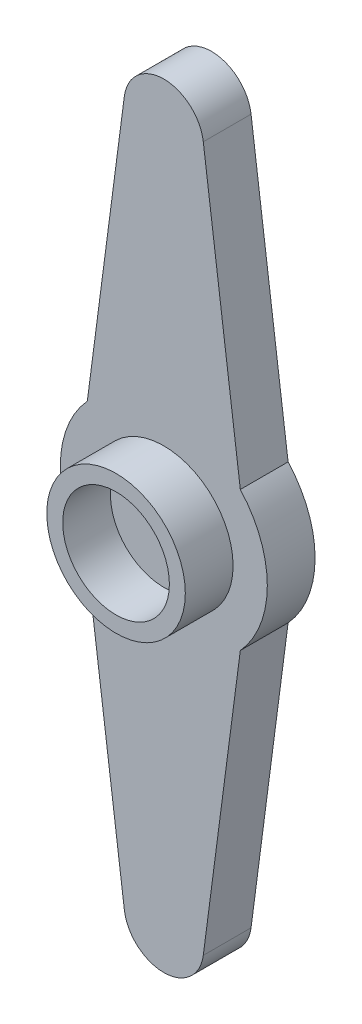
ISO-10303-21;
HEADER;
FILE_DESCRIPTION(('STEP AP214'),'2;1');
FILE_NAME('part.step','',(''),(''),'','','');
FILE_SCHEMA(('AUTOMOTIVE_DESIGN { 1 0 10303 214 1 1 1 1 }'));
ENDSEC;
DATA;
#1=APPLICATION_CONTEXT('core data for automotive mechanical design processes');
#2=APPLICATION_PROTOCOL_DEFINITION('international standard','automotive_design',2000,#1);
#3=PRODUCT_CONTEXT('',#1,'mechanical');
#4=PRODUCT('Part','Part','',(#3));
#5=PRODUCT_RELATED_PRODUCT_CATEGORY('part','',(#4));
#6=PRODUCT_DEFINITION_FORMATION('','',#4);
#7=PRODUCT_DEFINITION_CONTEXT('part definition',#1,'design');
#8=PRODUCT_DEFINITION('design','',#6,#7);
#9=PRODUCT_DEFINITION_SHAPE('','',#8);
#10=(LENGTH_UNIT() NAMED_UNIT(*) SI_UNIT(.MILLI.,.METRE.));
#11=(NAMED_UNIT(*) PLANE_ANGLE_UNIT() SI_UNIT($,.RADIAN.));
#12=(NAMED_UNIT(*) SI_UNIT($,.STERADIAN.) SOLID_ANGLE_UNIT());
#13=UNCERTAINTY_MEASURE_WITH_UNIT(LENGTH_MEASURE(1.E-05),#10,'distance_accuracy_value','');
#14=(GEOMETRIC_REPRESENTATION_CONTEXT(3) GLOBAL_UNCERTAINTY_ASSIGNED_CONTEXT((#13)) GLOBAL_UNIT_ASSIGNED_CONTEXT((#10,
#11,#12)) REPRESENTATION_CONTEXT('',''));
#15=CARTESIAN_POINT('',(0.,0.,0.));
#16=DIRECTION('',(0.,0.,1.));
#17=DIRECTION('',(1.,0.,0.));
#18=AXIS2_PLACEMENT_3D('',#15,#16,#17);
#19=CARTESIAN_POINT('',(0.,21.8,3.));
#20=DIRECTION('',(0.,0.,1.));
#21=DIRECTION('',(1.,0.,0.));
#22=AXIS2_PLACEMENT_3D('',#19,#20,#21);
#23=PLANE('',#22);
#24=CARTESIAN_POINT('',(0.,21.8,3.));
#25=DIRECTION('',(0.,0.,1.));
#26=DIRECTION('',(1.,0.,0.));
#27=AXIS2_PLACEMENT_3D('',#24,#25,#26);
#28=CIRCLE('',#27,2.5);
#29=CARTESIAN_POINT('',(2.47880079624715,22.124879381501,3.));
#30=VERTEX_POINT('',#29);
#31=CARTESIAN_POINT('',(-2.47880079624715,22.124879381501,3.));
#32=VERTEX_POINT('',#31);
#33=EDGE_CURVE('E156',#30,#32,#28,.T.);
#34=ORIENTED_EDGE('',*,*,#33,.T.);
#35=DIRECTION('',(-0.129951752600411,-0.99152031849886,0.));
#36=VECTOR('',#35,1.);
#37=CARTESIAN_POINT('',(-2.47880079624715,22.124879381501,3.));
#38=LINE('',#37,#36);
#39=CARTESIAN_POINT('',(-4.80480817683197,4.3776498699472,3.));
#40=VERTEX_POINT('',#39);
#41=EDGE_CURVE('E104',#32,#40,#38,.T.);
#42=ORIENTED_EDGE('',*,*,#41,.T.);
#43=CARTESIAN_POINT('',(0.,0.,3.));
#44=DIRECTION('',(0.,0.,1.));
#45=DIRECTION('',(1.,0.,0.));
#46=AXIS2_PLACEMENT_3D('',#43,#44,#45);
#47=CIRCLE('',#46,6.50000000000001);
#48=CARTESIAN_POINT('',(-4.80480817683199,-4.37764986994717,3.));
#49=VERTEX_POINT('',#48);
#50=EDGE_CURVE('E187',#40,#49,#47,.T.);
#51=ORIENTED_EDGE('',*,*,#50,.T.);
#52=DIRECTION('',(0.129951752600404,-0.991520318498861,0.));
#53=VECTOR('',#52,1.);
#54=CARTESIAN_POINT('',(-2.47880079624731,-22.124879381501,3.));
#55=LINE('',#54,#53);
#56=CARTESIAN_POINT('',(-2.47880079624731,-22.124879381501,3.));
#57=VERTEX_POINT('',#56);
#58=EDGE_CURVE('E186',#49,#57,#55,.T.);
#59=ORIENTED_EDGE('',*,*,#58,.T.);
#60=CARTESIAN_POINT('',(-1.52228586373561E-13,-21.8,3.));
#61=DIRECTION('',(0.,0.,1.));
#62=DIRECTION('',(1.,0.,0.));
#63=AXIS2_PLACEMENT_3D('',#60,#61,#62);
#64=CIRCLE('',#63,2.5);
#65=CARTESIAN_POINT('',(2.478800796247,-22.124879381501,3.));
#66=VERTEX_POINT('',#65);
#67=EDGE_CURVE('E123',#57,#66,#64,.T.);
#68=ORIENTED_EDGE('',*,*,#67,.T.);
#69=DIRECTION('',(0.129951752600418,0.991520318498859,0.));
#70=VECTOR('',#69,1.);
#71=CARTESIAN_POINT('',(2.478800796247,-22.124879381501,3.));
#72=LINE('',#71,#70);
#73=CARTESIAN_POINT('',(4.80480817683194,-4.37764986994723,3.));
#74=VERTEX_POINT('',#73);
#75=EDGE_CURVE('E117',#66,#74,#72,.T.);
#76=ORIENTED_EDGE('',*,*,#75,.T.);
#77=CARTESIAN_POINT('',(0.,0.,3.));
#78=DIRECTION('',(0.,0.,1.));
#79=DIRECTION('',(1.,0.,0.));
#80=AXIS2_PLACEMENT_3D('',#77,#78,#79);
#81=CIRCLE('',#80,6.50000000000001);
#82=CARTESIAN_POINT('',(4.80480817683196,4.37764986994721,3.));
#83=VERTEX_POINT('',#82);
#84=EDGE_CURVE('E121',#74,#83,#81,.T.);
#85=ORIENTED_EDGE('',*,*,#84,.T.);
#86=DIRECTION('',(-0.129951752600411,0.99152031849886,0.));
#87=VECTOR('',#86,1.);
#88=CARTESIAN_POINT('',(2.47880079624715,22.124879381501,3.));
#89=LINE('',#88,#87);
#90=EDGE_CURVE('E60',#83,#30,#89,.T.);
#91=ORIENTED_EDGE('',*,*,#90,.T.);
#92=EDGE_LOOP('',(#34,#42,#51,#59,#68,#76,#85,#91));
#93=FACE_BOUND('',#92,.T.);
#94=CARTESIAN_POINT('',(0.,0.,3.));
#95=DIRECTION('',(0.,0.,1.));
#96=DIRECTION('',(1.,0.,0.));
#97=AXIS2_PLACEMENT_3D('',#94,#95,#96);
#98=CIRCLE('',#97,4.35);
#99=CARTESIAN_POINT('',(4.35,0.,3.));
#100=VERTEX_POINT('',#99);
#101=EDGE_CURVE('E196',#100,#100,#98,.T.);
#102=ORIENTED_EDGE('',*,*,#101,.F.);
#103=EDGE_LOOP('',(#102));
#104=FACE_BOUND('',#103,.T.);
#105=ADVANCED_FACE('F43',(#93,#104),#23,.T.);
#106=CARTESIAN_POINT('',(0.,21.8,3.));
#107=DIRECTION('',(0.,0.,-1.));
#108=DIRECTION('',(-1.,0.,0.));
#109=AXIS2_PLACEMENT_3D('',#106,#107,#108);
#110=CYLINDRICAL_SURFACE('',#109,2.5);
#111=CARTESIAN_POINT('',(0.,21.8,0.));
#112=DIRECTION('',(0.,0.,1.));
#113=DIRECTION('',(1.,0.,0.));
#114=AXIS2_PLACEMENT_3D('',#111,#112,#113);
#115=CIRCLE('',#114,2.5);
#116=CARTESIAN_POINT('',(2.47880079624715,22.124879381501,0.));
#117=VERTEX_POINT('',#116);
#118=CARTESIAN_POINT('',(-2.47880079624715,22.124879381501,0.));
#119=VERTEX_POINT('',#118);
#120=EDGE_CURVE('E141',#117,#119,#115,.T.);
#121=ORIENTED_EDGE('',*,*,#120,.T.);
#122=DIRECTION('',(0.,0.,-1.));
#123=VECTOR('',#122,1.);
#124=CARTESIAN_POINT('',(-2.47880079624715,22.124879381501,3.));
#125=LINE('',#124,#123);
#126=EDGE_CURVE('E52',#32,#119,#125,.T.);
#127=ORIENTED_EDGE('',*,*,#126,.F.);
#128=ORIENTED_EDGE('',*,*,#33,.F.);
#129=DIRECTION('',(0.,0.,-1.));
#130=VECTOR('',#129,1.);
#131=CARTESIAN_POINT('',(2.47880079624715,22.124879381501,3.));
#132=LINE('',#131,#130);
#133=EDGE_CURVE('E137',#30,#117,#132,.T.);
#134=ORIENTED_EDGE('',*,*,#133,.T.);
#135=EDGE_LOOP('',(#121,#127,#128,#134));
#136=FACE_BOUND('',#135,.T.);
#137=ADVANCED_FACE('F45',(#136),#110,.T.);
#138=CARTESIAN_POINT('',(-2.47880079624715,22.124879381501,3.));
#139=DIRECTION('',(0.99152031849886,-0.129951752600411,0.));
#140=DIRECTION('',(0.129951752600411,0.99152031849886,0.));
#141=AXIS2_PLACEMENT_3D('',#138,#139,#140);
#142=PLANE('',#141);
#143=DIRECTION('',(-0.129951752600411,-0.99152031849886,0.));
#144=VECTOR('',#143,1.);
#145=CARTESIAN_POINT('',(-2.47880079624715,22.124879381501,0.));
#146=LINE('',#145,#144);
#147=CARTESIAN_POINT('',(-4.80480817683197,4.3776498699472,0.));
#148=VERTEX_POINT('',#147);
#149=EDGE_CURVE('E144',#119,#148,#146,.T.);
#150=ORIENTED_EDGE('',*,*,#149,.T.);
#151=DIRECTION('',(0.,0.,-1.));
#152=VECTOR('',#151,1.);
#153=CARTESIAN_POINT('',(-4.80480817683197,4.3776498699472,3.));
#154=LINE('',#153,#152);
#155=EDGE_CURVE('E166',#40,#148,#154,.T.);
#156=ORIENTED_EDGE('',*,*,#155,.F.);
#157=ORIENTED_EDGE('',*,*,#41,.F.);
#158=ORIENTED_EDGE('',*,*,#126,.T.);
#159=EDGE_LOOP('',(#150,#156,#157,#158));
#160=FACE_BOUND('',#159,.T.);
#161=ADVANCED_FACE('F169',(#160),#142,.F.);
#162=CARTESIAN_POINT('',(0.,0.,3.));
#163=DIRECTION('',(0.,0.,-1.));
#164=DIRECTION('',(-1.,0.,0.));
#165=AXIS2_PLACEMENT_3D('',#162,#163,#164);
#166=CYLINDRICAL_SURFACE('',#165,6.50000000000001);
#167=CARTESIAN_POINT('',(0.,0.,0.));
#168=DIRECTION('',(0.,0.,1.));
#169=DIRECTION('',(1.,0.,0.));
#170=AXIS2_PLACEMENT_3D('',#167,#168,#169);
#171=CIRCLE('',#170,6.50000000000001);
#172=CARTESIAN_POINT('',(-4.80480817683199,-4.37764986994717,0.));
#173=VERTEX_POINT('',#172);
#174=EDGE_CURVE('E147',#148,#173,#171,.T.);
#175=ORIENTED_EDGE('',*,*,#174,.T.);
#176=DIRECTION('',(0.,0.,-1.));
#177=VECTOR('',#176,1.);
#178=CARTESIAN_POINT('',(-4.80480817683199,-4.37764986994717,3.));
#179=LINE('',#178,#177);
#180=EDGE_CURVE('E163',#49,#173,#179,.T.);
#181=ORIENTED_EDGE('',*,*,#180,.F.);
#182=ORIENTED_EDGE('',*,*,#50,.F.);
#183=ORIENTED_EDGE('',*,*,#155,.T.);
#184=EDGE_LOOP('',(#175,#181,#182,#183));
#185=FACE_BOUND('',#184,.T.);
#186=ADVANCED_FACE('F180',(#185),#166,.T.);
#187=CARTESIAN_POINT('',(-2.47880079624731,-22.124879381501,3.));
#188=DIRECTION('',(0.991520318498861,0.129951752600404,0.));
#189=DIRECTION('',(-0.129951752600404,0.991520318498861,0.));
#190=AXIS2_PLACEMENT_3D('',#187,#188,#189);
#191=PLANE('',#190);
#192=DIRECTION('',(0.129951752600404,-0.991520318498861,0.));
#193=VECTOR('',#192,1.);
#194=CARTESIAN_POINT('',(-2.47880079624731,-22.124879381501,0.));
#195=LINE('',#194,#193);
#196=CARTESIAN_POINT('',(-2.47880079624731,-22.124879381501,0.));
#197=VERTEX_POINT('',#196);
#198=EDGE_CURVE('E149',#173,#197,#195,.T.);
#199=ORIENTED_EDGE('',*,*,#198,.T.);
#200=DIRECTION('',(0.,0.,-1.));
#201=VECTOR('',#200,1.);
#202=CARTESIAN_POINT('',(-2.47880079624731,-22.124879381501,3.));
#203=LINE('',#202,#201);
#204=EDGE_CURVE('E160',#57,#197,#203,.T.);
#205=ORIENTED_EDGE('',*,*,#204,.F.);
#206=ORIENTED_EDGE('',*,*,#58,.F.);
#207=ORIENTED_EDGE('',*,*,#180,.T.);
#208=EDGE_LOOP('',(#199,#205,#206,#207));
#209=FACE_BOUND('',#208,.T.);
#210=ADVANCED_FACE('F184',(#209),#191,.F.);
#211=CARTESIAN_POINT('',(-1.52228586373561E-13,-21.8,3.));
#212=DIRECTION('',(0.,0.,-1.));
#213=DIRECTION('',(-1.,0.,0.));
#214=AXIS2_PLACEMENT_3D('',#211,#212,#213);
#215=CYLINDRICAL_SURFACE('',#214,2.5);
#216=CARTESIAN_POINT('',(-1.52228586373561E-13,-21.8,0.));
#217=DIRECTION('',(0.,0.,1.));
#218=DIRECTION('',(1.,0.,0.));
#219=AXIS2_PLACEMENT_3D('',#216,#217,#218);
#220=CIRCLE('',#219,2.5);
#221=CARTESIAN_POINT('',(2.478800796247,-22.124879381501,0.));
#222=VERTEX_POINT('',#221);
#223=EDGE_CURVE('E151',#197,#222,#220,.T.);
#224=ORIENTED_EDGE('',*,*,#223,.T.);
#225=DIRECTION('',(0.,0.,-1.));
#226=VECTOR('',#225,1.);
#227=CARTESIAN_POINT('',(2.478800796247,-22.124879381501,3.));
#228=LINE('',#227,#226);
#229=EDGE_CURVE('E132',#66,#222,#228,.T.);
#230=ORIENTED_EDGE('',*,*,#229,.F.);
#231=ORIENTED_EDGE('',*,*,#67,.F.);
#232=ORIENTED_EDGE('',*,*,#204,.T.);
#233=EDGE_LOOP('',(#224,#230,#231,#232));
#234=FACE_BOUND('',#233,.T.);
#235=ADVANCED_FACE('F279',(#234),#215,.T.);
#236=CARTESIAN_POINT('',(2.478800796247,-22.124879381501,3.));
#237=DIRECTION('',(-0.99152031849886,0.129951752600418,0.));
#238=DIRECTION('',(-0.129951752600418,-0.99152031849886,0.));
#239=AXIS2_PLACEMENT_3D('',#236,#237,#238);
#240=PLANE('',#239);
#241=DIRECTION('',(0.129951752600418,0.991520318498859,0.));
#242=VECTOR('',#241,1.);
#243=CARTESIAN_POINT('',(2.478800796247,-22.124879381501,0.));
#244=LINE('',#243,#242);
#245=CARTESIAN_POINT('',(4.80480817683194,-4.37764986994723,0.));
#246=VERTEX_POINT('',#245);
#247=EDGE_CURVE('E131',#222,#246,#244,.T.);
#248=ORIENTED_EDGE('',*,*,#247,.T.);
#249=DIRECTION('',(0.,0.,-1.));
#250=VECTOR('',#249,1.);
#251=CARTESIAN_POINT('',(4.80480817683194,-4.37764986994723,3.));
#252=LINE('',#251,#250);
#253=EDGE_CURVE('E128',#74,#246,#252,.T.);
#254=ORIENTED_EDGE('',*,*,#253,.F.);
#255=ORIENTED_EDGE('',*,*,#75,.F.);
#256=ORIENTED_EDGE('',*,*,#229,.T.);
#257=EDGE_LOOP('',(#248,#254,#255,#256));
#258=FACE_BOUND('',#257,.T.);
#259=ADVANCED_FACE('F129',(#258),#240,.F.);
#260=CARTESIAN_POINT('',(0.,0.,3.));
#261=DIRECTION('',(0.,0.,-1.));
#262=DIRECTION('',(-1.,0.,0.));
#263=AXIS2_PLACEMENT_3D('',#260,#261,#262);
#264=CYLINDRICAL_SURFACE('',#263,6.50000000000001);
#265=CARTESIAN_POINT('',(0.,0.,0.));
#266=DIRECTION('',(0.,0.,1.));
#267=DIRECTION('',(1.,0.,0.));
#268=AXIS2_PLACEMENT_3D('',#265,#266,#267);
#269=CIRCLE('',#268,6.50000000000001);
#270=CARTESIAN_POINT('',(4.80480817683196,4.37764986994721,0.));
#271=VERTEX_POINT('',#270);
#272=EDGE_CURVE('E89',#246,#271,#269,.T.);
#273=ORIENTED_EDGE('',*,*,#272,.T.);
#274=DIRECTION('',(0.,0.,-1.));
#275=VECTOR('',#274,1.);
#276=CARTESIAN_POINT('',(4.80480817683196,4.37764986994721,3.));
#277=LINE('',#276,#275);
#278=EDGE_CURVE('E133',#83,#271,#277,.T.);
#279=ORIENTED_EDGE('',*,*,#278,.F.);
#280=ORIENTED_EDGE('',*,*,#84,.F.);
#281=ORIENTED_EDGE('',*,*,#253,.T.);
#282=EDGE_LOOP('',(#273,#279,#280,#281));
#283=FACE_BOUND('',#282,.T.);
#284=ADVANCED_FACE('F135',(#283),#264,.T.);
#285=CARTESIAN_POINT('',(2.47880079624715,22.124879381501,3.));
#286=DIRECTION('',(-0.99152031849886,-0.129951752600411,0.));
#287=DIRECTION('',(0.129951752600411,-0.99152031849886,0.));
#288=AXIS2_PLACEMENT_3D('',#285,#286,#287);
#289=PLANE('',#288);
#290=DIRECTION('',(-0.129951752600411,0.99152031849886,0.));
#291=VECTOR('',#290,1.);
#292=CARTESIAN_POINT('',(2.47880079624715,22.124879381501,0.));
#293=LINE('',#292,#291);
#294=EDGE_CURVE('E95',#271,#117,#293,.T.);
#295=ORIENTED_EDGE('',*,*,#294,.T.);
#296=ORIENTED_EDGE('',*,*,#133,.F.);
#297=ORIENTED_EDGE('',*,*,#90,.F.);
#298=ORIENTED_EDGE('',*,*,#278,.T.);
#299=EDGE_LOOP('',(#295,#296,#297,#298));
#300=FACE_BOUND('',#299,.T.);
#301=ADVANCED_FACE('F215',(#300),#289,.F.);
#302=CARTESIAN_POINT('',(0.,21.8,0.));
#303=DIRECTION('',(0.,0.,1.));
#304=DIRECTION('',(1.,0.,0.));
#305=AXIS2_PLACEMENT_3D('',#302,#303,#304);
#306=PLANE('',#305);
#307=ORIENTED_EDGE('',*,*,#120,.F.);
#308=ORIENTED_EDGE('',*,*,#294,.F.);
#309=ORIENTED_EDGE('',*,*,#272,.F.);
#310=ORIENTED_EDGE('',*,*,#247,.F.);
#311=ORIENTED_EDGE('',*,*,#223,.F.);
#312=ORIENTED_EDGE('',*,*,#198,.F.);
#313=ORIENTED_EDGE('',*,*,#174,.F.);
#314=ORIENTED_EDGE('',*,*,#149,.F.);
#315=EDGE_LOOP('',(#307,#308,#309,#310,#311,#312,#313,#314));
#316=FACE_BOUND('',#315,.T.);
#317=ADVANCED_FACE('F174',(#316),#306,.F.);
#318=CARTESIAN_POINT('',(0.,0.,24.3036579926459));
#319=DIRECTION('',(0.,0.,-1.));
#320=DIRECTION('',(-1.,0.,0.));
#321=AXIS2_PLACEMENT_3D('',#318,#319,#320);
#322=CYLINDRICAL_SURFACE('',#321,4.35);
#323=ORIENTED_EDGE('',*,*,#101,.T.);
#324=EDGE_LOOP('',(#323));
#325=FACE_BOUND('',#324,.T.);
#326=CARTESIAN_POINT('',(0.,0.,6.));
#327=DIRECTION('',(0.,0.,1.));
#328=DIRECTION('',(1.,0.,0.));
#329=AXIS2_PLACEMENT_3D('',#326,#327,#328);
#330=CIRCLE('',#329,4.35);
#331=CARTESIAN_POINT('',(4.35,0.,6.));
#332=VERTEX_POINT('',#331);
#333=EDGE_CURVE('E145',#332,#332,#330,.T.);
#334=ORIENTED_EDGE('',*,*,#333,.F.);
#335=EDGE_LOOP('',(#334));
#336=FACE_BOUND('',#335,.T.);
#337=ADVANCED_FACE('F204',(#325,#336),#322,.T.);
#338=CARTESIAN_POINT('',(0.,0.,24.3036579926459));
#339=DIRECTION('',(0.,0.,-1.));
#340=DIRECTION('',(-1.,0.,0.));
#341=AXIS2_PLACEMENT_3D('',#338,#339,#340);
#342=CYLINDRICAL_SURFACE('',#341,3.35);
#343=CARTESIAN_POINT('',(0.,0.,3.));
#344=DIRECTION('',(0.,0.,1.));
#345=DIRECTION('',(1.,0.,0.));
#346=AXIS2_PLACEMENT_3D('',#343,#344,#345);
#347=CIRCLE('',#346,3.35);
#348=CARTESIAN_POINT('',(3.35,0.,3.));
#349=VERTEX_POINT('',#348);
#350=EDGE_CURVE('E13',#349,#349,#347,.F.);
#351=ORIENTED_EDGE('',*,*,#350,.T.);
#352=EDGE_LOOP('',(#351));
#353=FACE_BOUND('',#352,.T.);
#354=CARTESIAN_POINT('',(0.,0.,6.));
#355=DIRECTION('',(0.,0.,1.));
#356=DIRECTION('',(1.,0.,0.));
#357=AXIS2_PLACEMENT_3D('',#354,#355,#356);
#358=CIRCLE('',#357,3.35);
#359=CARTESIAN_POINT('',(3.35,0.,6.));
#360=VERTEX_POINT('',#359);
#361=EDGE_CURVE('E193',#360,#360,#358,.T.);
#362=ORIENTED_EDGE('',*,*,#361,.T.);
#363=EDGE_LOOP('',(#362));
#364=FACE_BOUND('',#363,.T.);
#365=ADVANCED_FACE('F206',(#353,#364),#342,.F.);
#366=CARTESIAN_POINT('',(0.,21.8,6.));
#367=DIRECTION('',(0.,0.,1.));
#368=DIRECTION('',(1.,0.,0.));
#369=AXIS2_PLACEMENT_3D('',#366,#367,#368);
#370=PLANE('',#369);
#371=ORIENTED_EDGE('',*,*,#361,.F.);
#372=EDGE_LOOP('',(#371));
#373=FACE_BOUND('',#372,.T.);
#374=ORIENTED_EDGE('',*,*,#333,.T.);
#375=EDGE_LOOP('',(#374));
#376=FACE_BOUND('',#375,.T.);
#377=ADVANCED_FACE('F202',(#373,#376),#370,.T.);
#378=ORIENTED_EDGE('',*,*,#350,.F.);
#379=EDGE_LOOP('',(#378));
#380=FACE_BOUND('',#379,.T.);
#381=ADVANCED_FACE('F219',(#380),#23,.T.);
#382=CLOSED_SHELL('',(#105,#137,#161,#186,#210,#235,#259,#284,#301,#317,#337,#365,#377,#381));
#383=MANIFOLD_SOLID_BREP('B2',#382);
#384=ADVANCED_BREP_SHAPE_REPRESENTATION('',(#18,#383),#14);
#385=SHAPE_DEFINITION_REPRESENTATION(#9,#384);
ENDSEC;
END-ISO-10303-21;
